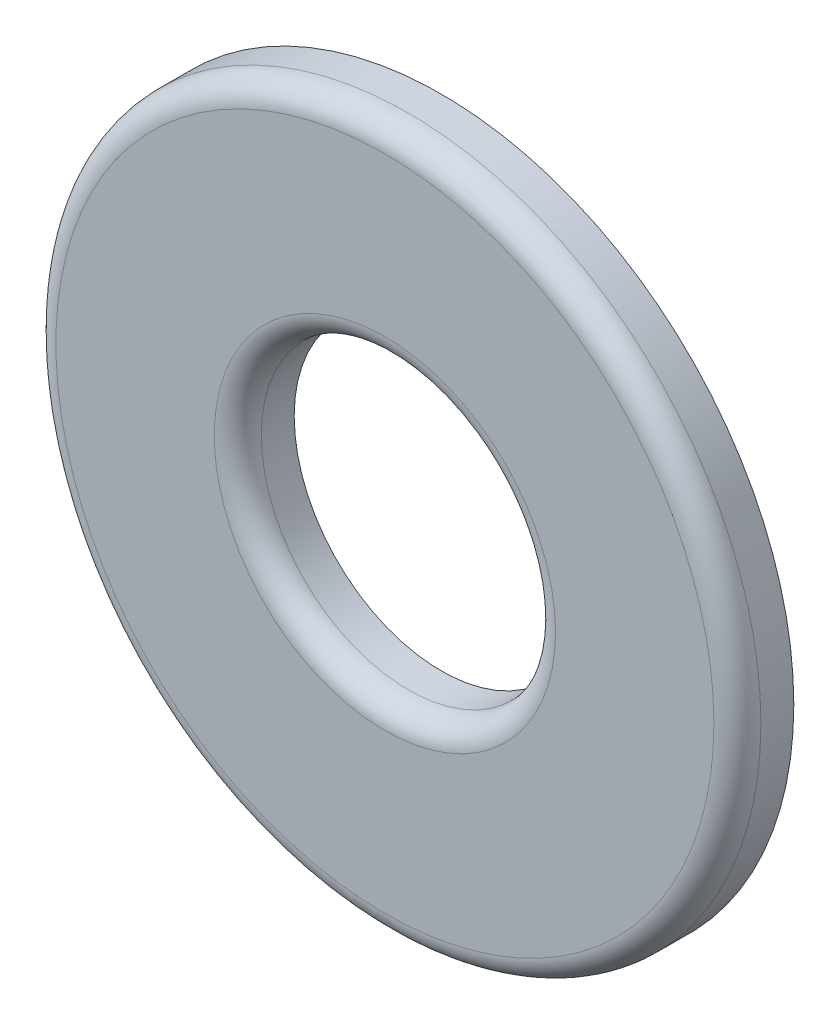
ISO-10303-21;
HEADER;
FILE_DESCRIPTION(('STEP AP214'),'2;1');
FILE_NAME('part.step','',(''),(''),'','','');
FILE_SCHEMA(('AUTOMOTIVE_DESIGN { 1 0 10303 214 1 1 1 1 }'));
ENDSEC;
DATA;
#1=APPLICATION_CONTEXT('core data for automotive mechanical design processes');
#2=APPLICATION_PROTOCOL_DEFINITION('international standard','automotive_design',2000,#1);
#3=PRODUCT_CONTEXT('',#1,'mechanical');
#4=PRODUCT('Part','Part','',(#3));
#5=PRODUCT_RELATED_PRODUCT_CATEGORY('part','',(#4));
#6=PRODUCT_DEFINITION_FORMATION('','',#4);
#7=PRODUCT_DEFINITION_CONTEXT('part definition',#1,'design');
#8=PRODUCT_DEFINITION('design','',#6,#7);
#9=PRODUCT_DEFINITION_SHAPE('','',#8);
#10=(LENGTH_UNIT() NAMED_UNIT(*) SI_UNIT(.MILLI.,.METRE.));
#11=(NAMED_UNIT(*) PLANE_ANGLE_UNIT() SI_UNIT($,.RADIAN.));
#12=(NAMED_UNIT(*) SI_UNIT($,.STERADIAN.) SOLID_ANGLE_UNIT());
#13=UNCERTAINTY_MEASURE_WITH_UNIT(LENGTH_MEASURE(1.E-05),#10,'distance_accuracy_value','');
#14=(GEOMETRIC_REPRESENTATION_CONTEXT(3) GLOBAL_UNCERTAINTY_ASSIGNED_CONTEXT((#13)) GLOBAL_UNIT_ASSIGNED_CONTEXT((#10,
#11,#12)) REPRESENTATION_CONTEXT('',''));
#15=CARTESIAN_POINT('',(0.,0.,0.));
#16=DIRECTION('',(0.,0.,1.));
#17=DIRECTION('',(1.,0.,0.));
#18=AXIS2_PLACEMENT_3D('',#15,#16,#17);
#19=CARTESIAN_POINT('',(0.,0.,1.524));
#20=DIRECTION('',(0.,0.,1.));
#21=DIRECTION('',(1.,0.,0.));
#22=AXIS2_PLACEMENT_3D('',#19,#20,#21);
#23=PLANE('',#22);
#24=CARTESIAN_POINT('',(0.,0.,1.524));
#25=DIRECTION('',(0.,0.,1.));
#26=DIRECTION('',(1.,0.,0.));
#27=AXIS2_PLACEMENT_3D('',#24,#25,#26);
#28=CIRCLE('',#27,4.6101);
#29=CARTESIAN_POINT('',(4.6101,0.,1.524));
#30=VERTEX_POINT('',#29);
#31=EDGE_CURVE('E39',#30,#30,#28,.F.);
#32=ORIENTED_EDGE('',*,*,#31,.T.);
#33=EDGE_LOOP('',(#32));
#34=FACE_BOUND('',#33,.T.);
#35=CARTESIAN_POINT('',(0.,0.,1.524));
#36=DIRECTION('',(0.,0.,1.));
#37=DIRECTION('',(1.,0.,0.));
#38=AXIS2_PLACEMENT_3D('',#35,#36,#37);
#39=CIRCLE('',#38,8.89);
#40=CARTESIAN_POINT('',(8.89,0.,1.524));
#41=VERTEX_POINT('',#40);
#42=EDGE_CURVE('E43',#41,#41,#39,.T.);
#43=ORIENTED_EDGE('',*,*,#42,.T.);
#44=EDGE_LOOP('',(#43));
#45=FACE_BOUND('',#44,.T.);
#46=ADVANCED_FACE('F32',(#34,#45),#23,.T.);
#47=CARTESIAN_POINT('',(0.,0.,0.));
#48=DIRECTION('',(0.,0.,1.));
#49=DIRECTION('',(1.,0.,0.));
#50=AXIS2_PLACEMENT_3D('',#47,#48,#49);
#51=PLANE('',#50);
#52=CARTESIAN_POINT('',(0.,0.,0.));
#53=DIRECTION('',(0.,0.,1.));
#54=DIRECTION('',(1.,0.,0.));
#55=AXIS2_PLACEMENT_3D('',#52,#53,#54);
#56=CIRCLE('',#55,9.525);
#57=CARTESIAN_POINT('',(9.525,0.,0.));
#58=VERTEX_POINT('',#57);
#59=EDGE_CURVE('E52',#58,#58,#56,.T.);
#60=ORIENTED_EDGE('',*,*,#59,.F.);
#61=EDGE_LOOP('',(#60));
#62=FACE_BOUND('',#61,.T.);
#63=CARTESIAN_POINT('',(0.,0.,0.));
#64=DIRECTION('',(0.,0.,1.));
#65=DIRECTION('',(1.,0.,0.));
#66=AXIS2_PLACEMENT_3D('',#63,#64,#65);
#67=CIRCLE('',#66,3.9751);
#68=CARTESIAN_POINT('',(3.9751,0.,0.));
#69=VERTEX_POINT('',#68);
#70=EDGE_CURVE('E55',#69,#69,#67,.T.);
#71=ORIENTED_EDGE('',*,*,#70,.T.);
#72=EDGE_LOOP('',(#71));
#73=FACE_BOUND('',#72,.T.);
#74=ADVANCED_FACE('F59',(#62,#73),#51,.F.);
#75=CARTESIAN_POINT('',(0.,0.,1.524));
#76=DIRECTION('',(0.,0.,-1.));
#77=DIRECTION('',(-1.,0.,0.));
#78=AXIS2_PLACEMENT_3D('',#75,#76,#77);
#79=CYLINDRICAL_SURFACE('',#78,9.525);
#80=CARTESIAN_POINT('',(0.,0.,0.889));
#81=DIRECTION('',(0.,0.,1.));
#82=DIRECTION('',(1.,0.,0.));
#83=AXIS2_PLACEMENT_3D('',#80,#81,#82);
#84=CIRCLE('',#83,9.525);
#85=CARTESIAN_POINT('',(9.525,0.,0.889));
#86=VERTEX_POINT('',#85);
#87=EDGE_CURVE('E10',#86,#86,#84,.F.);
#88=ORIENTED_EDGE('',*,*,#87,.T.);
#89=EDGE_LOOP('',(#88));
#90=FACE_BOUND('',#89,.T.);
#91=ORIENTED_EDGE('',*,*,#59,.T.);
#92=EDGE_LOOP('',(#91));
#93=FACE_BOUND('',#92,.T.);
#94=ADVANCED_FACE('F64',(#90,#93),#79,.T.);
#95=CARTESIAN_POINT('',(0.,0.,1.524));
#96=DIRECTION('',(0.,0.,-1.));
#97=DIRECTION('',(-1.,0.,0.));
#98=AXIS2_PLACEMENT_3D('',#95,#96,#97);
#99=CYLINDRICAL_SURFACE('',#98,3.9751);
#100=CARTESIAN_POINT('',(0.,0.,0.889));
#101=DIRECTION('',(0.,0.,1.));
#102=DIRECTION('',(1.,0.,0.));
#103=AXIS2_PLACEMENT_3D('',#100,#101,#102);
#104=CIRCLE('',#103,3.9751);
#105=CARTESIAN_POINT('',(3.9751,0.,0.889));
#106=VERTEX_POINT('',#105);
#107=EDGE_CURVE('E47',#106,#106,#104,.T.);
#108=ORIENTED_EDGE('',*,*,#107,.T.);
#109=EDGE_LOOP('',(#108));
#110=FACE_BOUND('',#109,.T.);
#111=ORIENTED_EDGE('',*,*,#70,.F.);
#112=EDGE_LOOP('',(#111));
#113=FACE_BOUND('',#112,.T.);
#114=ADVANCED_FACE('F61',(#110,#113),#99,.F.);
#115=CARTESIAN_POINT('',(0.,0.,0.889));
#116=DIRECTION('',(0.,0.,1.));
#117=DIRECTION('',(1.,0.,0.));
#118=AXIS2_PLACEMENT_3D('',#115,#116,#117);
#119=TOROIDAL_SURFACE('',#118,4.6101,0.635);
#120=ORIENTED_EDGE('',*,*,#31,.F.);
#121=EDGE_LOOP('',(#120));
#122=FACE_BOUND('',#121,.T.);
#123=ORIENTED_EDGE('',*,*,#107,.F.);
#124=EDGE_LOOP('',(#123));
#125=FACE_BOUND('',#124,.T.);
#126=ADVANCED_FACE('F63',(#122,#125),#119,.T.);
#127=CARTESIAN_POINT('',(0.,0.,0.889));
#128=DIRECTION('',(0.,0.,1.));
#129=DIRECTION('',(1.,0.,0.));
#130=AXIS2_PLACEMENT_3D('',#127,#128,#129);
#131=TOROIDAL_SURFACE('',#130,8.89,0.635);
#132=ORIENTED_EDGE('',*,*,#87,.F.);
#133=EDGE_LOOP('',(#132));
#134=FACE_BOUND('',#133,.T.);
#135=ORIENTED_EDGE('',*,*,#42,.F.);
#136=EDGE_LOOP('',(#135));
#137=FACE_BOUND('',#136,.T.);
#138=ADVANCED_FACE('F34',(#134,#137),#131,.T.);
#139=CLOSED_SHELL('',(#46,#74,#94,#114,#126,#138));
#140=MANIFOLD_SOLID_BREP('B2',#139);
#141=ADVANCED_BREP_SHAPE_REPRESENTATION('',(#18,#140),#14);
#142=SHAPE_DEFINITION_REPRESENTATION(#9,#141);
ENDSEC;
END-ISO-10303-21;
